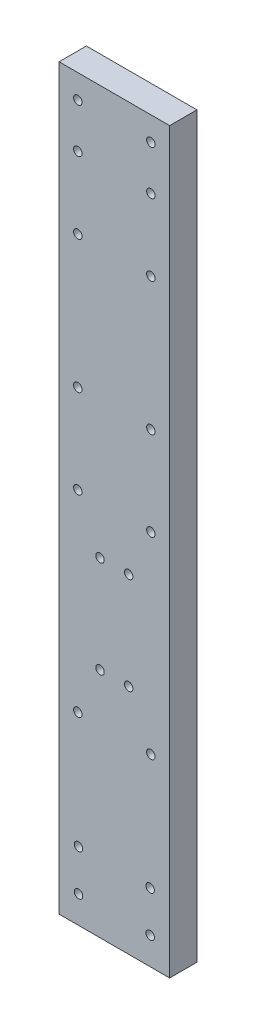
ISO-10303-21;
HEADER;
FILE_DESCRIPTION(('STEP AP214'),'2;1');
FILE_NAME('part.step','',(''),(''),'','','');
FILE_SCHEMA(('AUTOMOTIVE_DESIGN { 1 0 10303 214 1 1 1 1 }'));
ENDSEC;
DATA;
#1=APPLICATION_CONTEXT('core data for automotive mechanical design processes');
#2=APPLICATION_PROTOCOL_DEFINITION('international standard','automotive_design',2000,#1);
#3=PRODUCT_CONTEXT('',#1,'mechanical');
#4=PRODUCT('Part','Part','',(#3));
#5=PRODUCT_RELATED_PRODUCT_CATEGORY('part','',(#4));
#6=PRODUCT_DEFINITION_FORMATION('','',#4);
#7=PRODUCT_DEFINITION_CONTEXT('part definition',#1,'design');
#8=PRODUCT_DEFINITION('design','',#6,#7);
#9=PRODUCT_DEFINITION_SHAPE('','',#8);
#10=(LENGTH_UNIT() NAMED_UNIT(*) SI_UNIT(.MILLI.,.METRE.));
#11=(NAMED_UNIT(*) PLANE_ANGLE_UNIT() SI_UNIT($,.RADIAN.));
#12=(NAMED_UNIT(*) SI_UNIT($,.STERADIAN.) SOLID_ANGLE_UNIT());
#13=UNCERTAINTY_MEASURE_WITH_UNIT(LENGTH_MEASURE(1.E-05),#10,'distance_accuracy_value','');
#14=(GEOMETRIC_REPRESENTATION_CONTEXT(3) GLOBAL_UNCERTAINTY_ASSIGNED_CONTEXT((#13)) GLOBAL_UNIT_ASSIGNED_CONTEXT((#10,
#11,#12)) REPRESENTATION_CONTEXT('',''));
#15=CARTESIAN_POINT('',(0.,0.,0.));
#16=DIRECTION('',(0.,0.,1.));
#17=DIRECTION('',(1.,0.,0.));
#18=AXIS2_PLACEMENT_3D('',#15,#16,#17);
#19=CARTESIAN_POINT('',(0.,0.,4.));
#20=DIRECTION('',(0.,0.,1.));
#21=DIRECTION('',(1.,0.,0.));
#22=AXIS2_PLACEMENT_3D('',#19,#20,#21);
#23=PLANE('',#22);
#24=CARTESIAN_POINT('',(13.35,10.,4.));
#25=DIRECTION('',(0.,0.,1.));
#26=DIRECTION('',(-1.,0.,0.));
#27=AXIS2_PLACEMENT_3D('',#24,#25,#26);
#28=CIRCLE('',#27,0.62);
#29=CARTESIAN_POINT('',(12.73,10.,4.));
#30=VERTEX_POINT('',#29);
#31=EDGE_CURVE('E217',#30,#30,#28,.T.);
#32=ORIENTED_EDGE('',*,*,#31,.F.);
#33=EDGE_LOOP('',(#32));
#34=FACE_BOUND('',#33,.T.);
#35=CARTESIAN_POINT('',(2.85,10.,4.));
#36=DIRECTION('',(0.,0.,1.));
#37=DIRECTION('',(1.,0.,0.));
#38=AXIS2_PLACEMENT_3D('',#35,#36,#37);
#39=CIRCLE('',#38,0.62);
#40=CARTESIAN_POINT('',(3.47,10.,4.));
#41=VERTEX_POINT('',#40);
#42=EDGE_CURVE('E205',#41,#41,#39,.T.);
#43=ORIENTED_EDGE('',*,*,#42,.F.);
#44=EDGE_LOOP('',(#43));
#45=FACE_BOUND('',#44,.T.);
#46=CARTESIAN_POINT('',(2.74999999999998,68.21,4.));
#47=DIRECTION('',(0.,0.,1.));
#48=DIRECTION('',(1.,0.,0.));
#49=AXIS2_PLACEMENT_3D('',#46,#47,#48);
#50=CIRCLE('',#49,0.620000000000002);
#51=CARTESIAN_POINT('',(3.36999999999999,68.21,4.));
#52=VERTEX_POINT('',#51);
#53=EDGE_CURVE('E193',#52,#52,#50,.T.);
#54=ORIENTED_EDGE('',*,*,#53,.F.);
#55=EDGE_LOOP('',(#54));
#56=FACE_BOUND('',#55,.T.);
#57=CARTESIAN_POINT('',(2.74999999999999,55.21,4.));
#58=DIRECTION('',(0.,0.,1.));
#59=DIRECTION('',(1.,0.,0.));
#60=AXIS2_PLACEMENT_3D('',#57,#58,#59);
#61=CIRCLE('',#60,0.62);
#62=CARTESIAN_POINT('',(3.36999999999999,55.21,4.));
#63=VERTEX_POINT('',#62);
#64=EDGE_CURVE('E181',#63,#63,#61,.T.);
#65=ORIENTED_EDGE('',*,*,#64,.F.);
#66=EDGE_LOOP('',(#65));
#67=FACE_BOUND('',#66,.T.);
#68=CARTESIAN_POINT('',(13.45,104.66,4.));
#69=DIRECTION('',(0.,0.,1.));
#70=DIRECTION('',(-1.,0.,0.));
#71=AXIS2_PLACEMENT_3D('',#68,#69,#70);
#72=CIRCLE('',#71,0.620000000000002);
#73=CARTESIAN_POINT('',(12.83,104.66,4.));
#74=VERTEX_POINT('',#73);
#75=EDGE_CURVE('E169',#74,#74,#72,.T.);
#76=ORIENTED_EDGE('',*,*,#75,.F.);
#77=EDGE_LOOP('',(#76));
#78=FACE_BOUND('',#77,.T.);
#79=CARTESIAN_POINT('',(2.74999999999998,87.66,4.));
#80=DIRECTION('',(0.,0.,1.));
#81=DIRECTION('',(-1.,0.,0.));
#82=AXIS2_PLACEMENT_3D('',#79,#80,#81);
#83=CIRCLE('',#82,0.620000000000002);
#84=CARTESIAN_POINT('',(2.12999999999998,87.66,4.));
#85=VERTEX_POINT('',#84);
#86=EDGE_CURVE('E157',#85,#85,#83,.T.);
#87=ORIENTED_EDGE('',*,*,#86,.F.);
#88=EDGE_LOOP('',(#87));
#89=FACE_BOUND('',#88,.T.);
#90=CARTESIAN_POINT('',(2.75,27.,4.));
#91=DIRECTION('',(0.,0.,1.));
#92=DIRECTION('',(1.,0.,0.));
#93=AXIS2_PLACEMENT_3D('',#90,#91,#92);
#94=CIRCLE('',#93,0.62);
#95=CARTESIAN_POINT('',(3.37,27.,4.));
#96=VERTEX_POINT('',#95);
#97=EDGE_CURVE('E145',#96,#96,#94,.T.);
#98=ORIENTED_EDGE('',*,*,#97,.F.);
#99=EDGE_LOOP('',(#98));
#100=FACE_BOUND('',#99,.T.);
#101=CARTESIAN_POINT('',(6.,34.,4.));
#102=DIRECTION('',(0.,0.,1.));
#103=DIRECTION('',(1.,0.,0.));
#104=AXIS2_PLACEMENT_3D('',#101,#102,#103);
#105=CIRCLE('',#104,0.619999999999999);
#106=CARTESIAN_POINT('',(6.62,34.,4.));
#107=VERTEX_POINT('',#106);
#108=EDGE_CURVE('E133',#107,#107,#105,.T.);
#109=ORIENTED_EDGE('',*,*,#108,.F.);
#110=EDGE_LOOP('',(#109));
#111=FACE_BOUND('',#110,.T.);
#112=CARTESIAN_POINT('',(5.99999999999999,48.21,4.));
#113=DIRECTION('',(0.,0.,1.));
#114=DIRECTION('',(1.,0.,0.));
#115=AXIS2_PLACEMENT_3D('',#112,#113,#114);
#116=CIRCLE('',#115,0.619999999999999);
#117=CARTESIAN_POINT('',(6.61999999999999,48.21,4.));
#118=VERTEX_POINT('',#117);
#119=EDGE_CURVE('E121',#118,#118,#116,.T.);
#120=ORIENTED_EDGE('',*,*,#119,.F.);
#121=EDGE_LOOP('',(#120));
#122=FACE_BOUND('',#121,.T.);
#123=CARTESIAN_POINT('',(2.74999999999999,104.66,4.));
#124=DIRECTION('',(0.,0.,1.));
#125=DIRECTION('',(1.,0.,0.));
#126=AXIS2_PLACEMENT_3D('',#123,#124,#125);
#127=CIRCLE('',#126,0.620000000000002);
#128=CARTESIAN_POINT('',(3.36999999999999,104.66,4.));
#129=VERTEX_POINT('',#128);
#130=EDGE_CURVE('E100',#129,#129,#127,.T.);
#131=ORIENTED_EDGE('',*,*,#130,.F.);
#132=EDGE_LOOP('',(#131));
#133=FACE_BOUND('',#132,.T.);
#134=DIRECTION('',(0.,-1.,0.));
#135=VECTOR('',#134,1.);
#136=CARTESIAN_POINT('',(0.,108.14,4.));
#137=LINE('',#136,#135);
#138=CARTESIAN_POINT('',(0.,108.14,4.));
#139=VERTEX_POINT('',#138);
#140=CARTESIAN_POINT('',(0.,0.,4.));
#141=VERTEX_POINT('',#140);
#142=EDGE_CURVE('E85',#139,#141,#137,.T.);
#143=ORIENTED_EDGE('',*,*,#142,.T.);
#144=DIRECTION('',(1.,0.,0.));
#145=VECTOR('',#144,1.);
#146=CARTESIAN_POINT('',(0.,0.,4.));
#147=LINE('',#146,#145);
#148=CARTESIAN_POINT('',(16.2,0.,4.));
#149=VERTEX_POINT('',#148);
#150=EDGE_CURVE('E80',#141,#149,#147,.T.);
#151=ORIENTED_EDGE('',*,*,#150,.T.);
#152=DIRECTION('',(0.,1.,0.));
#153=VECTOR('',#152,1.);
#154=CARTESIAN_POINT('',(16.2,0.,4.));
#155=LINE('',#154,#153);
#156=CARTESIAN_POINT('',(16.2,108.14,4.));
#157=VERTEX_POINT('',#156);
#158=EDGE_CURVE('E83',#149,#157,#155,.T.);
#159=ORIENTED_EDGE('',*,*,#158,.T.);
#160=DIRECTION('',(-1.,0.,0.));
#161=VECTOR('',#160,1.);
#162=CARTESIAN_POINT('',(16.2,108.14,4.));
#163=LINE('',#162,#161);
#164=EDGE_CURVE('E50',#157,#139,#163,.T.);
#165=ORIENTED_EDGE('',*,*,#164,.T.);
#166=EDGE_LOOP('',(#143,#151,#159,#165));
#167=FACE_BOUND('',#166,.T.);
#168=CARTESIAN_POINT('',(10.2,48.21,4.));
#169=DIRECTION('',(0.,0.,1.));
#170=DIRECTION('',(1.,0.,0.));
#171=AXIS2_PLACEMENT_3D('',#168,#169,#170);
#172=CIRCLE('',#171,0.62);
#173=CARTESIAN_POINT('',(10.82,48.21,4.));
#174=VERTEX_POINT('',#173);
#175=EDGE_CURVE('E115',#174,#174,#172,.T.);
#176=ORIENTED_EDGE('',*,*,#175,.F.);
#177=EDGE_LOOP('',(#176));
#178=FACE_BOUND('',#177,.T.);
#179=CARTESIAN_POINT('',(10.2,34.,4.));
#180=DIRECTION('',(0.,0.,1.));
#181=DIRECTION('',(1.,0.,0.));
#182=AXIS2_PLACEMENT_3D('',#179,#180,#181);
#183=CIRCLE('',#182,0.62);
#184=CARTESIAN_POINT('',(10.82,34.,4.));
#185=VERTEX_POINT('',#184);
#186=EDGE_CURVE('E127',#185,#185,#183,.T.);
#187=ORIENTED_EDGE('',*,*,#186,.F.);
#188=EDGE_LOOP('',(#187));
#189=FACE_BOUND('',#188,.T.);
#190=CARTESIAN_POINT('',(13.45,27.,4.));
#191=DIRECTION('',(0.,0.,1.));
#192=DIRECTION('',(1.,0.,0.));
#193=AXIS2_PLACEMENT_3D('',#190,#191,#192);
#194=CIRCLE('',#193,0.62);
#195=CARTESIAN_POINT('',(14.07,27.,4.));
#196=VERTEX_POINT('',#195);
#197=EDGE_CURVE('E139',#196,#196,#194,.T.);
#198=ORIENTED_EDGE('',*,*,#197,.F.);
#199=EDGE_LOOP('',(#198));
#200=FACE_BOUND('',#199,.T.);
#201=CARTESIAN_POINT('',(13.45,55.21,4.));
#202=DIRECTION('',(0.,0.,1.));
#203=DIRECTION('',(1.,0.,0.));
#204=AXIS2_PLACEMENT_3D('',#201,#202,#203);
#205=CIRCLE('',#204,0.62);
#206=CARTESIAN_POINT('',(14.07,55.21,4.));
#207=VERTEX_POINT('',#206);
#208=EDGE_CURVE('E151',#207,#207,#205,.T.);
#209=ORIENTED_EDGE('',*,*,#208,.F.);
#210=EDGE_LOOP('',(#209));
#211=FACE_BOUND('',#210,.T.);
#212=CARTESIAN_POINT('',(13.45,87.66,4.));
#213=DIRECTION('',(0.,0.,1.));
#214=DIRECTION('',(-1.,0.,0.));
#215=AXIS2_PLACEMENT_3D('',#212,#213,#214);
#216=CIRCLE('',#215,0.620000000000002);
#217=CARTESIAN_POINT('',(12.83,87.66,4.));
#218=VERTEX_POINT('',#217);
#219=EDGE_CURVE('E163',#218,#218,#216,.T.);
#220=ORIENTED_EDGE('',*,*,#219,.F.);
#221=EDGE_LOOP('',(#220));
#222=FACE_BOUND('',#221,.T.);
#223=CARTESIAN_POINT('',(13.45,98.16,4.));
#224=DIRECTION('',(0.,0.,1.));
#225=DIRECTION('',(-1.,0.,0.));
#226=AXIS2_PLACEMENT_3D('',#223,#224,#225);
#227=CIRCLE('',#226,0.620000000000002);
#228=CARTESIAN_POINT('',(12.83,98.16,4.));
#229=VERTEX_POINT('',#228);
#230=EDGE_CURVE('E175',#229,#229,#227,.T.);
#231=ORIENTED_EDGE('',*,*,#230,.F.);
#232=EDGE_LOOP('',(#231));
#233=FACE_BOUND('',#232,.T.);
#234=CARTESIAN_POINT('',(13.45,68.21,4.));
#235=DIRECTION('',(0.,0.,1.));
#236=DIRECTION('',(1.,0.,0.));
#237=AXIS2_PLACEMENT_3D('',#234,#235,#236);
#238=CIRCLE('',#237,0.620000000000002);
#239=CARTESIAN_POINT('',(14.07,68.21,4.));
#240=VERTEX_POINT('',#239);
#241=EDGE_CURVE('E187',#240,#240,#238,.T.);
#242=ORIENTED_EDGE('',*,*,#241,.F.);
#243=EDGE_LOOP('',(#242));
#244=FACE_BOUND('',#243,.T.);
#245=CARTESIAN_POINT('',(2.74999999999999,98.16,4.));
#246=DIRECTION('',(0.,0.,1.));
#247=DIRECTION('',(1.,0.,0.));
#248=AXIS2_PLACEMENT_3D('',#245,#246,#247);
#249=CIRCLE('',#248,0.620000000000002);
#250=CARTESIAN_POINT('',(3.36999999999999,98.16,4.));
#251=VERTEX_POINT('',#250);
#252=EDGE_CURVE('E199',#251,#251,#249,.T.);
#253=ORIENTED_EDGE('',*,*,#252,.F.);
#254=EDGE_LOOP('',(#253));
#255=FACE_BOUND('',#254,.T.);
#256=CARTESIAN_POINT('',(2.85,4.,4.));
#257=DIRECTION('',(0.,0.,1.));
#258=DIRECTION('',(1.,0.,0.));
#259=AXIS2_PLACEMENT_3D('',#256,#257,#258);
#260=CIRCLE('',#259,0.62);
#261=CARTESIAN_POINT('',(3.47,4.,4.));
#262=VERTEX_POINT('',#261);
#263=EDGE_CURVE('E211',#262,#262,#260,.T.);
#264=ORIENTED_EDGE('',*,*,#263,.F.);
#265=EDGE_LOOP('',(#264));
#266=FACE_BOUND('',#265,.T.);
#267=CARTESIAN_POINT('',(13.35,4.,4.));
#268=DIRECTION('',(0.,0.,1.));
#269=DIRECTION('',(-1.,0.,0.));
#270=AXIS2_PLACEMENT_3D('',#267,#268,#269);
#271=CIRCLE('',#270,0.620000000000001);
#272=CARTESIAN_POINT('',(12.73,4.,4.));
#273=VERTEX_POINT('',#272);
#274=EDGE_CURVE('E223',#273,#273,#271,.T.);
#275=ORIENTED_EDGE('',*,*,#274,.F.);
#276=EDGE_LOOP('',(#275));
#277=FACE_BOUND('',#276,.T.);
#278=ADVANCED_FACE('F33',(#34,#45,#56,#67,#78,#89,#100,#111,#122,#133,#167,#178,#189,#200,#211,
#222,#233,#244,#255,#266,#277),#23,.T.);
#279=CARTESIAN_POINT('',(0.,0.,0.));
#280=DIRECTION('',(0.,0.,1.));
#281=DIRECTION('',(1.,0.,0.));
#282=AXIS2_PLACEMENT_3D('',#279,#280,#281);
#283=PLANE('',#282);
#284=CARTESIAN_POINT('',(13.35,10.,0.));
#285=DIRECTION('',(0.,0.,1.));
#286=DIRECTION('',(-1.,0.,0.));
#287=AXIS2_PLACEMENT_3D('',#284,#285,#286);
#288=CIRCLE('',#287,0.62);
#289=CARTESIAN_POINT('',(12.73,10.,0.));
#290=VERTEX_POINT('',#289);
#291=EDGE_CURVE('E220',#290,#290,#288,.T.);
#292=ORIENTED_EDGE('',*,*,#291,.T.);
#293=EDGE_LOOP('',(#292));
#294=FACE_BOUND('',#293,.T.);
#295=CARTESIAN_POINT('',(2.85,10.,0.));
#296=DIRECTION('',(0.,0.,1.));
#297=DIRECTION('',(1.,0.,0.));
#298=AXIS2_PLACEMENT_3D('',#295,#296,#297);
#299=CIRCLE('',#298,0.62);
#300=CARTESIAN_POINT('',(3.47,10.,0.));
#301=VERTEX_POINT('',#300);
#302=EDGE_CURVE('E208',#301,#301,#299,.T.);
#303=ORIENTED_EDGE('',*,*,#302,.T.);
#304=EDGE_LOOP('',(#303));
#305=FACE_BOUND('',#304,.T.);
#306=CARTESIAN_POINT('',(2.74999999999998,68.21,0.));
#307=DIRECTION('',(0.,0.,1.));
#308=DIRECTION('',(1.,0.,0.));
#309=AXIS2_PLACEMENT_3D('',#306,#307,#308);
#310=CIRCLE('',#309,0.620000000000002);
#311=CARTESIAN_POINT('',(3.36999999999999,68.21,0.));
#312=VERTEX_POINT('',#311);
#313=EDGE_CURVE('E196',#312,#312,#310,.T.);
#314=ORIENTED_EDGE('',*,*,#313,.T.);
#315=EDGE_LOOP('',(#314));
#316=FACE_BOUND('',#315,.T.);
#317=CARTESIAN_POINT('',(2.74999999999999,55.21,0.));
#318=DIRECTION('',(0.,0.,1.));
#319=DIRECTION('',(1.,0.,0.));
#320=AXIS2_PLACEMENT_3D('',#317,#318,#319);
#321=CIRCLE('',#320,0.62);
#322=CARTESIAN_POINT('',(3.36999999999999,55.21,0.));
#323=VERTEX_POINT('',#322);
#324=EDGE_CURVE('E184',#323,#323,#321,.T.);
#325=ORIENTED_EDGE('',*,*,#324,.T.);
#326=EDGE_LOOP('',(#325));
#327=FACE_BOUND('',#326,.T.);
#328=CARTESIAN_POINT('',(13.45,104.66,0.));
#329=DIRECTION('',(0.,0.,1.));
#330=DIRECTION('',(-1.,0.,0.));
#331=AXIS2_PLACEMENT_3D('',#328,#329,#330);
#332=CIRCLE('',#331,0.620000000000002);
#333=CARTESIAN_POINT('',(12.83,104.66,0.));
#334=VERTEX_POINT('',#333);
#335=EDGE_CURVE('E172',#334,#334,#332,.T.);
#336=ORIENTED_EDGE('',*,*,#335,.T.);
#337=EDGE_LOOP('',(#336));
#338=FACE_BOUND('',#337,.T.);
#339=CARTESIAN_POINT('',(2.74999999999998,87.66,0.));
#340=DIRECTION('',(0.,0.,1.));
#341=DIRECTION('',(-1.,0.,0.));
#342=AXIS2_PLACEMENT_3D('',#339,#340,#341);
#343=CIRCLE('',#342,0.620000000000002);
#344=CARTESIAN_POINT('',(2.12999999999998,87.66,0.));
#345=VERTEX_POINT('',#344);
#346=EDGE_CURVE('E160',#345,#345,#343,.T.);
#347=ORIENTED_EDGE('',*,*,#346,.T.);
#348=EDGE_LOOP('',(#347));
#349=FACE_BOUND('',#348,.T.);
#350=CARTESIAN_POINT('',(2.75,27.,0.));
#351=DIRECTION('',(0.,0.,1.));
#352=DIRECTION('',(1.,0.,0.));
#353=AXIS2_PLACEMENT_3D('',#350,#351,#352);
#354=CIRCLE('',#353,0.62);
#355=CARTESIAN_POINT('',(3.37,27.,0.));
#356=VERTEX_POINT('',#355);
#357=EDGE_CURVE('E148',#356,#356,#354,.T.);
#358=ORIENTED_EDGE('',*,*,#357,.T.);
#359=EDGE_LOOP('',(#358));
#360=FACE_BOUND('',#359,.T.);
#361=CARTESIAN_POINT('',(6.,34.,0.));
#362=DIRECTION('',(0.,0.,1.));
#363=DIRECTION('',(1.,0.,0.));
#364=AXIS2_PLACEMENT_3D('',#361,#362,#363);
#365=CIRCLE('',#364,0.619999999999999);
#366=CARTESIAN_POINT('',(6.62,34.,0.));
#367=VERTEX_POINT('',#366);
#368=EDGE_CURVE('E136',#367,#367,#365,.T.);
#369=ORIENTED_EDGE('',*,*,#368,.T.);
#370=EDGE_LOOP('',(#369));
#371=FACE_BOUND('',#370,.T.);
#372=CARTESIAN_POINT('',(5.99999999999999,48.21,0.));
#373=DIRECTION('',(0.,0.,1.));
#374=DIRECTION('',(1.,0.,0.));
#375=AXIS2_PLACEMENT_3D('',#372,#373,#374);
#376=CIRCLE('',#375,0.619999999999999);
#377=CARTESIAN_POINT('',(6.61999999999999,48.21,0.));
#378=VERTEX_POINT('',#377);
#379=EDGE_CURVE('E124',#378,#378,#376,.T.);
#380=ORIENTED_EDGE('',*,*,#379,.T.);
#381=EDGE_LOOP('',(#380));
#382=FACE_BOUND('',#381,.T.);
#383=CARTESIAN_POINT('',(2.74999999999999,104.66,0.));
#384=DIRECTION('',(0.,0.,1.));
#385=DIRECTION('',(1.,0.,0.));
#386=AXIS2_PLACEMENT_3D('',#383,#384,#385);
#387=CIRCLE('',#386,0.620000000000002);
#388=CARTESIAN_POINT('',(3.36999999999999,104.66,0.));
#389=VERTEX_POINT('',#388);
#390=EDGE_CURVE('E112',#389,#389,#387,.T.);
#391=ORIENTED_EDGE('',*,*,#390,.T.);
#392=EDGE_LOOP('',(#391));
#393=FACE_BOUND('',#392,.T.);
#394=DIRECTION('',(0.,-1.,0.));
#395=VECTOR('',#394,1.);
#396=CARTESIAN_POINT('',(0.,108.14,0.));
#397=LINE('',#396,#395);
#398=CARTESIAN_POINT('',(0.,108.14,0.));
#399=VERTEX_POINT('',#398);
#400=CARTESIAN_POINT('',(0.,0.,0.));
#401=VERTEX_POINT('',#400);
#402=EDGE_CURVE('E97',#399,#401,#397,.T.);
#403=ORIENTED_EDGE('',*,*,#402,.F.);
#404=DIRECTION('',(-1.,0.,0.));
#405=VECTOR('',#404,1.);
#406=CARTESIAN_POINT('',(16.2,108.14,0.));
#407=LINE('',#406,#405);
#408=CARTESIAN_POINT('',(16.2,108.14,0.));
#409=VERTEX_POINT('',#408);
#410=EDGE_CURVE('E73',#409,#399,#407,.T.);
#411=ORIENTED_EDGE('',*,*,#410,.F.);
#412=DIRECTION('',(0.,1.,0.));
#413=VECTOR('',#412,1.);
#414=CARTESIAN_POINT('',(16.2,0.,0.));
#415=LINE('',#414,#413);
#416=CARTESIAN_POINT('',(16.2,0.,0.));
#417=VERTEX_POINT('',#416);
#418=EDGE_CURVE('E67',#417,#409,#415,.T.);
#419=ORIENTED_EDGE('',*,*,#418,.F.);
#420=DIRECTION('',(1.,0.,0.));
#421=VECTOR('',#420,1.);
#422=CARTESIAN_POINT('',(0.,0.,0.));
#423=LINE('',#422,#421);
#424=EDGE_CURVE('E89',#401,#417,#423,.T.);
#425=ORIENTED_EDGE('',*,*,#424,.F.);
#426=EDGE_LOOP('',(#403,#411,#419,#425));
#427=FACE_BOUND('',#426,.T.);
#428=CARTESIAN_POINT('',(10.2,48.21,0.));
#429=DIRECTION('',(0.,0.,1.));
#430=DIRECTION('',(1.,0.,0.));
#431=AXIS2_PLACEMENT_3D('',#428,#429,#430);
#432=CIRCLE('',#431,0.62);
#433=CARTESIAN_POINT('',(10.82,48.21,0.));
#434=VERTEX_POINT('',#433);
#435=EDGE_CURVE('E118',#434,#434,#432,.T.);
#436=ORIENTED_EDGE('',*,*,#435,.T.);
#437=EDGE_LOOP('',(#436));
#438=FACE_BOUND('',#437,.T.);
#439=CARTESIAN_POINT('',(10.2,34.,0.));
#440=DIRECTION('',(0.,0.,1.));
#441=DIRECTION('',(1.,0.,0.));
#442=AXIS2_PLACEMENT_3D('',#439,#440,#441);
#443=CIRCLE('',#442,0.62);
#444=CARTESIAN_POINT('',(10.82,34.,0.));
#445=VERTEX_POINT('',#444);
#446=EDGE_CURVE('E130',#445,#445,#443,.T.);
#447=ORIENTED_EDGE('',*,*,#446,.T.);
#448=EDGE_LOOP('',(#447));
#449=FACE_BOUND('',#448,.T.);
#450=CARTESIAN_POINT('',(13.45,27.,0.));
#451=DIRECTION('',(0.,0.,1.));
#452=DIRECTION('',(1.,0.,0.));
#453=AXIS2_PLACEMENT_3D('',#450,#451,#452);
#454=CIRCLE('',#453,0.62);
#455=CARTESIAN_POINT('',(14.07,27.,0.));
#456=VERTEX_POINT('',#455);
#457=EDGE_CURVE('E142',#456,#456,#454,.T.);
#458=ORIENTED_EDGE('',*,*,#457,.T.);
#459=EDGE_LOOP('',(#458));
#460=FACE_BOUND('',#459,.T.);
#461=CARTESIAN_POINT('',(13.45,55.21,0.));
#462=DIRECTION('',(0.,0.,1.));
#463=DIRECTION('',(1.,0.,0.));
#464=AXIS2_PLACEMENT_3D('',#461,#462,#463);
#465=CIRCLE('',#464,0.62);
#466=CARTESIAN_POINT('',(14.07,55.21,0.));
#467=VERTEX_POINT('',#466);
#468=EDGE_CURVE('E154',#467,#467,#465,.T.);
#469=ORIENTED_EDGE('',*,*,#468,.T.);
#470=EDGE_LOOP('',(#469));
#471=FACE_BOUND('',#470,.T.);
#472=CARTESIAN_POINT('',(13.45,87.66,0.));
#473=DIRECTION('',(0.,0.,1.));
#474=DIRECTION('',(-1.,0.,0.));
#475=AXIS2_PLACEMENT_3D('',#472,#473,#474);
#476=CIRCLE('',#475,0.620000000000002);
#477=CARTESIAN_POINT('',(12.83,87.66,0.));
#478=VERTEX_POINT('',#477);
#479=EDGE_CURVE('E166',#478,#478,#476,.T.);
#480=ORIENTED_EDGE('',*,*,#479,.T.);
#481=EDGE_LOOP('',(#480));
#482=FACE_BOUND('',#481,.T.);
#483=CARTESIAN_POINT('',(13.45,98.16,0.));
#484=DIRECTION('',(0.,0.,1.));
#485=DIRECTION('',(-1.,0.,0.));
#486=AXIS2_PLACEMENT_3D('',#483,#484,#485);
#487=CIRCLE('',#486,0.620000000000002);
#488=CARTESIAN_POINT('',(12.83,98.16,0.));
#489=VERTEX_POINT('',#488);
#490=EDGE_CURVE('E178',#489,#489,#487,.T.);
#491=ORIENTED_EDGE('',*,*,#490,.T.);
#492=EDGE_LOOP('',(#491));
#493=FACE_BOUND('',#492,.T.);
#494=CARTESIAN_POINT('',(13.45,68.21,0.));
#495=DIRECTION('',(0.,0.,1.));
#496=DIRECTION('',(1.,0.,0.));
#497=AXIS2_PLACEMENT_3D('',#494,#495,#496);
#498=CIRCLE('',#497,0.620000000000002);
#499=CARTESIAN_POINT('',(14.07,68.21,0.));
#500=VERTEX_POINT('',#499);
#501=EDGE_CURVE('E190',#500,#500,#498,.T.);
#502=ORIENTED_EDGE('',*,*,#501,.T.);
#503=EDGE_LOOP('',(#502));
#504=FACE_BOUND('',#503,.T.);
#505=CARTESIAN_POINT('',(2.74999999999999,98.16,0.));
#506=DIRECTION('',(0.,0.,1.));
#507=DIRECTION('',(1.,0.,0.));
#508=AXIS2_PLACEMENT_3D('',#505,#506,#507);
#509=CIRCLE('',#508,0.620000000000002);
#510=CARTESIAN_POINT('',(3.36999999999999,98.16,0.));
#511=VERTEX_POINT('',#510);
#512=EDGE_CURVE('E202',#511,#511,#509,.T.);
#513=ORIENTED_EDGE('',*,*,#512,.T.);
#514=EDGE_LOOP('',(#513));
#515=FACE_BOUND('',#514,.T.);
#516=CARTESIAN_POINT('',(2.85,4.,0.));
#517=DIRECTION('',(0.,0.,1.));
#518=DIRECTION('',(1.,0.,0.));
#519=AXIS2_PLACEMENT_3D('',#516,#517,#518);
#520=CIRCLE('',#519,0.62);
#521=CARTESIAN_POINT('',(3.47,4.,0.));
#522=VERTEX_POINT('',#521);
#523=EDGE_CURVE('E214',#522,#522,#520,.T.);
#524=ORIENTED_EDGE('',*,*,#523,.T.);
#525=EDGE_LOOP('',(#524));
#526=FACE_BOUND('',#525,.T.);
#527=CARTESIAN_POINT('',(13.35,4.,0.));
#528=DIRECTION('',(0.,0.,1.));
#529=DIRECTION('',(-1.,0.,0.));
#530=AXIS2_PLACEMENT_3D('',#527,#528,#529);
#531=CIRCLE('',#530,0.620000000000001);
#532=CARTESIAN_POINT('',(12.73,4.,0.));
#533=VERTEX_POINT('',#532);
#534=EDGE_CURVE('E226',#533,#533,#531,.T.);
#535=ORIENTED_EDGE('',*,*,#534,.T.);
#536=EDGE_LOOP('',(#535));
#537=FACE_BOUND('',#536,.T.);
#538=ADVANCED_FACE('F108',(#294,#305,#316,#327,#338,#349,#360,#371,#382,#393,#427,#438,#449,
#460,#471,#482,#493,#504,#515,#526,#537),#283,.F.);
#539=CARTESIAN_POINT('',(0.,108.14,4.));
#540=DIRECTION('',(1.,0.,0.));
#541=DIRECTION('',(0.,1.,0.));
#542=AXIS2_PLACEMENT_3D('',#539,#540,#541);
#543=PLANE('',#542);
#544=ORIENTED_EDGE('',*,*,#402,.T.);
#545=DIRECTION('',(0.,0.,-1.));
#546=VECTOR('',#545,1.);
#547=CARTESIAN_POINT('',(0.,0.,4.));
#548=LINE('',#547,#546);
#549=EDGE_CURVE('E11',#141,#401,#548,.T.);
#550=ORIENTED_EDGE('',*,*,#549,.F.);
#551=ORIENTED_EDGE('',*,*,#142,.F.);
#552=DIRECTION('',(0.,0.,-1.));
#553=VECTOR('',#552,1.);
#554=CARTESIAN_POINT('',(0.,108.14,4.));
#555=LINE('',#554,#553);
#556=EDGE_CURVE('E93',#139,#399,#555,.T.);
#557=ORIENTED_EDGE('',*,*,#556,.T.);
#558=EDGE_LOOP('',(#544,#550,#551,#557));
#559=FACE_BOUND('',#558,.T.);
#560=ADVANCED_FACE('F35',(#559),#543,.F.);
#561=CARTESIAN_POINT('',(0.,0.,4.));
#562=DIRECTION('',(0.,1.,0.));
#563=DIRECTION('',(-1.,0.,0.));
#564=AXIS2_PLACEMENT_3D('',#561,#562,#563);
#565=PLANE('',#564);
#566=ORIENTED_EDGE('',*,*,#424,.T.);
#567=DIRECTION('',(0.,0.,-1.));
#568=VECTOR('',#567,1.);
#569=CARTESIAN_POINT('',(16.2,0.,4.));
#570=LINE('',#569,#568);
#571=EDGE_CURVE('E42',#149,#417,#570,.T.);
#572=ORIENTED_EDGE('',*,*,#571,.F.);
#573=ORIENTED_EDGE('',*,*,#150,.F.);
#574=ORIENTED_EDGE('',*,*,#549,.T.);
#575=EDGE_LOOP('',(#566,#572,#573,#574));
#576=FACE_BOUND('',#575,.T.);
#577=ADVANCED_FACE('F88',(#576),#565,.F.);
#578=CARTESIAN_POINT('',(16.2,0.,4.));
#579=DIRECTION('',(-1.,0.,0.));
#580=DIRECTION('',(0.,-1.,0.));
#581=AXIS2_PLACEMENT_3D('',#578,#579,#580);
#582=PLANE('',#581);
#583=ORIENTED_EDGE('',*,*,#418,.T.);
#584=DIRECTION('',(0.,0.,-1.));
#585=VECTOR('',#584,1.);
#586=CARTESIAN_POINT('',(16.2,108.14,4.));
#587=LINE('',#586,#585);
#588=EDGE_CURVE('E90',#157,#409,#587,.T.);
#589=ORIENTED_EDGE('',*,*,#588,.F.);
#590=ORIENTED_EDGE('',*,*,#158,.F.);
#591=ORIENTED_EDGE('',*,*,#571,.T.);
#592=EDGE_LOOP('',(#583,#589,#590,#591));
#593=FACE_BOUND('',#592,.T.);
#594=ADVANCED_FACE('F91',(#593),#582,.F.);
#595=CARTESIAN_POINT('',(16.2,108.14,4.));
#596=DIRECTION('',(0.,-1.,0.));
#597=DIRECTION('',(0.,0.,-1.));
#598=AXIS2_PLACEMENT_3D('',#595,#596,#597);
#599=PLANE('',#598);
#600=ORIENTED_EDGE('',*,*,#410,.T.);
#601=ORIENTED_EDGE('',*,*,#556,.F.);
#602=ORIENTED_EDGE('',*,*,#164,.F.);
#603=ORIENTED_EDGE('',*,*,#588,.T.);
#604=EDGE_LOOP('',(#600,#601,#602,#603));
#605=FACE_BOUND('',#604,.T.);
#606=ADVANCED_FACE('F105',(#605),#599,.F.);
#607=CARTESIAN_POINT('',(2.74999999999999,104.66,4.));
#608=DIRECTION('',(0.,0.,-1.));
#609=DIRECTION('',(-1.,0.,0.));
#610=AXIS2_PLACEMENT_3D('',#607,#608,#609);
#611=CYLINDRICAL_SURFACE('',#610,0.620000000000002);
#612=ORIENTED_EDGE('',*,*,#130,.T.);
#613=EDGE_LOOP('',(#612));
#614=FACE_BOUND('',#613,.T.);
#615=ORIENTED_EDGE('',*,*,#390,.F.);
#616=EDGE_LOOP('',(#615));
#617=FACE_BOUND('',#616,.T.);
#618=ADVANCED_FACE('F246',(#614,#617),#611,.F.);
#619=CARTESIAN_POINT('',(10.2,48.21,4.));
#620=DIRECTION('',(0.,0.,-1.));
#621=DIRECTION('',(-1.,0.,0.));
#622=AXIS2_PLACEMENT_3D('',#619,#620,#621);
#623=CYLINDRICAL_SURFACE('',#622,0.62);
#624=ORIENTED_EDGE('',*,*,#175,.T.);
#625=EDGE_LOOP('',(#624));
#626=FACE_BOUND('',#625,.T.);
#627=ORIENTED_EDGE('',*,*,#435,.F.);
#628=EDGE_LOOP('',(#627));
#629=FACE_BOUND('',#628,.T.);
#630=ADVANCED_FACE('F292',(#626,#629),#623,.F.);
#631=CARTESIAN_POINT('',(5.99999999999999,48.21,4.));
#632=DIRECTION('',(0.,0.,-1.));
#633=DIRECTION('',(-1.,0.,0.));
#634=AXIS2_PLACEMENT_3D('',#631,#632,#633);
#635=CYLINDRICAL_SURFACE('',#634,0.619999999999999);
#636=ORIENTED_EDGE('',*,*,#119,.T.);
#637=EDGE_LOOP('',(#636));
#638=FACE_BOUND('',#637,.T.);
#639=ORIENTED_EDGE('',*,*,#379,.F.);
#640=EDGE_LOOP('',(#639));
#641=FACE_BOUND('',#640,.T.);
#642=ADVANCED_FACE('F300',(#638,#641),#635,.F.);
#643=CARTESIAN_POINT('',(10.2,34.,4.));
#644=DIRECTION('',(0.,0.,-1.));
#645=DIRECTION('',(-1.,0.,0.));
#646=AXIS2_PLACEMENT_3D('',#643,#644,#645);
#647=CYLINDRICAL_SURFACE('',#646,0.62);
#648=ORIENTED_EDGE('',*,*,#186,.T.);
#649=EDGE_LOOP('',(#648));
#650=FACE_BOUND('',#649,.T.);
#651=ORIENTED_EDGE('',*,*,#446,.F.);
#652=EDGE_LOOP('',(#651));
#653=FACE_BOUND('',#652,.T.);
#654=ADVANCED_FACE('F308',(#650,#653),#647,.F.);
#655=CARTESIAN_POINT('',(6.,34.,4.));
#656=DIRECTION('',(0.,0.,-1.));
#657=DIRECTION('',(-1.,0.,0.));
#658=AXIS2_PLACEMENT_3D('',#655,#656,#657);
#659=CYLINDRICAL_SURFACE('',#658,0.619999999999999);
#660=ORIENTED_EDGE('',*,*,#108,.T.);
#661=EDGE_LOOP('',(#660));
#662=FACE_BOUND('',#661,.T.);
#663=ORIENTED_EDGE('',*,*,#368,.F.);
#664=EDGE_LOOP('',(#663));
#665=FACE_BOUND('',#664,.T.);
#666=ADVANCED_FACE('F317',(#662,#665),#659,.F.);
#667=CARTESIAN_POINT('',(13.45,27.,4.));
#668=DIRECTION('',(0.,0.,-1.));
#669=DIRECTION('',(-1.,0.,0.));
#670=AXIS2_PLACEMENT_3D('',#667,#668,#669);
#671=CYLINDRICAL_SURFACE('',#670,0.62);
#672=ORIENTED_EDGE('',*,*,#197,.T.);
#673=EDGE_LOOP('',(#672));
#674=FACE_BOUND('',#673,.T.);
#675=ORIENTED_EDGE('',*,*,#457,.F.);
#676=EDGE_LOOP('',(#675));
#677=FACE_BOUND('',#676,.T.);
#678=ADVANCED_FACE('F326',(#674,#677),#671,.F.);
#679=CARTESIAN_POINT('',(2.75,27.,4.));
#680=DIRECTION('',(0.,0.,-1.));
#681=DIRECTION('',(-1.,0.,0.));
#682=AXIS2_PLACEMENT_3D('',#679,#680,#681);
#683=CYLINDRICAL_SURFACE('',#682,0.62);
#684=ORIENTED_EDGE('',*,*,#97,.T.);
#685=EDGE_LOOP('',(#684));
#686=FACE_BOUND('',#685,.T.);
#687=ORIENTED_EDGE('',*,*,#357,.F.);
#688=EDGE_LOOP('',(#687));
#689=FACE_BOUND('',#688,.T.);
#690=ADVANCED_FACE('F335',(#686,#689),#683,.F.);
#691=CARTESIAN_POINT('',(13.45,55.21,4.));
#692=DIRECTION('',(0.,0.,-1.));
#693=DIRECTION('',(-1.,0.,0.));
#694=AXIS2_PLACEMENT_3D('',#691,#692,#693);
#695=CYLINDRICAL_SURFACE('',#694,0.62);
#696=ORIENTED_EDGE('',*,*,#208,.T.);
#697=EDGE_LOOP('',(#696));
#698=FACE_BOUND('',#697,.T.);
#699=ORIENTED_EDGE('',*,*,#468,.F.);
#700=EDGE_LOOP('',(#699));
#701=FACE_BOUND('',#700,.T.);
#702=ADVANCED_FACE('F344',(#698,#701),#695,.F.);
#703=CARTESIAN_POINT('',(2.74999999999998,87.66,4.));
#704=DIRECTION('',(0.,0.,-1.));
#705=DIRECTION('',(-1.,0.,0.));
#706=AXIS2_PLACEMENT_3D('',#703,#704,#705);
#707=CYLINDRICAL_SURFACE('',#706,0.620000000000002);
#708=ORIENTED_EDGE('',*,*,#86,.T.);
#709=EDGE_LOOP('',(#708));
#710=FACE_BOUND('',#709,.T.);
#711=ORIENTED_EDGE('',*,*,#346,.F.);
#712=EDGE_LOOP('',(#711));
#713=FACE_BOUND('',#712,.T.);
#714=ADVANCED_FACE('F353',(#710,#713),#707,.F.);
#715=CARTESIAN_POINT('',(13.45,87.66,4.));
#716=DIRECTION('',(0.,0.,-1.));
#717=DIRECTION('',(-1.,0.,0.));
#718=AXIS2_PLACEMENT_3D('',#715,#716,#717);
#719=CYLINDRICAL_SURFACE('',#718,0.620000000000002);
#720=ORIENTED_EDGE('',*,*,#219,.T.);
#721=EDGE_LOOP('',(#720));
#722=FACE_BOUND('',#721,.T.);
#723=ORIENTED_EDGE('',*,*,#479,.F.);
#724=EDGE_LOOP('',(#723));
#725=FACE_BOUND('',#724,.T.);
#726=ADVANCED_FACE('F362',(#722,#725),#719,.F.);
#727=CARTESIAN_POINT('',(13.45,104.66,4.));
#728=DIRECTION('',(0.,0.,-1.));
#729=DIRECTION('',(-1.,0.,0.));
#730=AXIS2_PLACEMENT_3D('',#727,#728,#729);
#731=CYLINDRICAL_SURFACE('',#730,0.620000000000002);
#732=ORIENTED_EDGE('',*,*,#75,.T.);
#733=EDGE_LOOP('',(#732));
#734=FACE_BOUND('',#733,.T.);
#735=ORIENTED_EDGE('',*,*,#335,.F.);
#736=EDGE_LOOP('',(#735));
#737=FACE_BOUND('',#736,.T.);
#738=ADVANCED_FACE('F371',(#734,#737),#731,.F.);
#739=CARTESIAN_POINT('',(13.45,98.16,4.));
#740=DIRECTION('',(0.,0.,-1.));
#741=DIRECTION('',(-1.,0.,0.));
#742=AXIS2_PLACEMENT_3D('',#739,#740,#741);
#743=CYLINDRICAL_SURFACE('',#742,0.620000000000002);
#744=ORIENTED_EDGE('',*,*,#230,.T.);
#745=EDGE_LOOP('',(#744));
#746=FACE_BOUND('',#745,.T.);
#747=ORIENTED_EDGE('',*,*,#490,.F.);
#748=EDGE_LOOP('',(#747));
#749=FACE_BOUND('',#748,.T.);
#750=ADVANCED_FACE('F380',(#746,#749),#743,.F.);
#751=CARTESIAN_POINT('',(2.74999999999999,55.21,4.));
#752=DIRECTION('',(0.,0.,-1.));
#753=DIRECTION('',(-1.,0.,0.));
#754=AXIS2_PLACEMENT_3D('',#751,#752,#753);
#755=CYLINDRICAL_SURFACE('',#754,0.62);
#756=ORIENTED_EDGE('',*,*,#64,.T.);
#757=EDGE_LOOP('',(#756));
#758=FACE_BOUND('',#757,.T.);
#759=ORIENTED_EDGE('',*,*,#324,.F.);
#760=EDGE_LOOP('',(#759));
#761=FACE_BOUND('',#760,.T.);
#762=ADVANCED_FACE('F389',(#758,#761),#755,.F.);
#763=CARTESIAN_POINT('',(13.45,68.21,4.));
#764=DIRECTION('',(0.,0.,-1.));
#765=DIRECTION('',(-1.,0.,0.));
#766=AXIS2_PLACEMENT_3D('',#763,#764,#765);
#767=CYLINDRICAL_SURFACE('',#766,0.620000000000002);
#768=ORIENTED_EDGE('',*,*,#241,.T.);
#769=EDGE_LOOP('',(#768));
#770=FACE_BOUND('',#769,.T.);
#771=ORIENTED_EDGE('',*,*,#501,.F.);
#772=EDGE_LOOP('',(#771));
#773=FACE_BOUND('',#772,.T.);
#774=ADVANCED_FACE('F398',(#770,#773),#767,.F.);
#775=CARTESIAN_POINT('',(2.74999999999998,68.21,4.));
#776=DIRECTION('',(0.,0.,-1.));
#777=DIRECTION('',(-1.,0.,0.));
#778=AXIS2_PLACEMENT_3D('',#775,#776,#777);
#779=CYLINDRICAL_SURFACE('',#778,0.620000000000002);
#780=ORIENTED_EDGE('',*,*,#53,.T.);
#781=EDGE_LOOP('',(#780));
#782=FACE_BOUND('',#781,.T.);
#783=ORIENTED_EDGE('',*,*,#313,.F.);
#784=EDGE_LOOP('',(#783));
#785=FACE_BOUND('',#784,.T.);
#786=ADVANCED_FACE('F407',(#782,#785),#779,.F.);
#787=CARTESIAN_POINT('',(2.74999999999999,98.16,4.));
#788=DIRECTION('',(0.,0.,-1.));
#789=DIRECTION('',(-1.,0.,0.));
#790=AXIS2_PLACEMENT_3D('',#787,#788,#789);
#791=CYLINDRICAL_SURFACE('',#790,0.620000000000002);
#792=ORIENTED_EDGE('',*,*,#252,.T.);
#793=EDGE_LOOP('',(#792));
#794=FACE_BOUND('',#793,.T.);
#795=ORIENTED_EDGE('',*,*,#512,.F.);
#796=EDGE_LOOP('',(#795));
#797=FACE_BOUND('',#796,.T.);
#798=ADVANCED_FACE('F416',(#794,#797),#791,.F.);
#799=CARTESIAN_POINT('',(2.85,10.,4.));
#800=DIRECTION('',(0.,0.,-1.));
#801=DIRECTION('',(-1.,0.,0.));
#802=AXIS2_PLACEMENT_3D('',#799,#800,#801);
#803=CYLINDRICAL_SURFACE('',#802,0.62);
#804=ORIENTED_EDGE('',*,*,#42,.T.);
#805=EDGE_LOOP('',(#804));
#806=FACE_BOUND('',#805,.T.);
#807=ORIENTED_EDGE('',*,*,#302,.F.);
#808=EDGE_LOOP('',(#807));
#809=FACE_BOUND('',#808,.T.);
#810=ADVANCED_FACE('F425',(#806,#809),#803,.F.);
#811=CARTESIAN_POINT('',(2.85,4.,4.));
#812=DIRECTION('',(0.,0.,-1.));
#813=DIRECTION('',(-1.,0.,0.));
#814=AXIS2_PLACEMENT_3D('',#811,#812,#813);
#815=CYLINDRICAL_SURFACE('',#814,0.62);
#816=ORIENTED_EDGE('',*,*,#263,.T.);
#817=EDGE_LOOP('',(#816));
#818=FACE_BOUND('',#817,.T.);
#819=ORIENTED_EDGE('',*,*,#523,.F.);
#820=EDGE_LOOP('',(#819));
#821=FACE_BOUND('',#820,.T.);
#822=ADVANCED_FACE('F434',(#818,#821),#815,.F.);
#823=CARTESIAN_POINT('',(13.35,10.,4.));
#824=DIRECTION('',(0.,0.,-1.));
#825=DIRECTION('',(-1.,0.,0.));
#826=AXIS2_PLACEMENT_3D('',#823,#824,#825);
#827=CYLINDRICAL_SURFACE('',#826,0.62);
#828=ORIENTED_EDGE('',*,*,#31,.T.);
#829=EDGE_LOOP('',(#828));
#830=FACE_BOUND('',#829,.T.);
#831=ORIENTED_EDGE('',*,*,#291,.F.);
#832=EDGE_LOOP('',(#831));
#833=FACE_BOUND('',#832,.T.);
#834=ADVANCED_FACE('F443',(#830,#833),#827,.F.);
#835=CARTESIAN_POINT('',(13.35,4.,4.));
#836=DIRECTION('',(0.,0.,-1.));
#837=DIRECTION('',(-1.,0.,0.));
#838=AXIS2_PLACEMENT_3D('',#835,#836,#837);
#839=CYLINDRICAL_SURFACE('',#838,0.620000000000001);
#840=ORIENTED_EDGE('',*,*,#274,.T.);
#841=EDGE_LOOP('',(#840));
#842=FACE_BOUND('',#841,.T.);
#843=ORIENTED_EDGE('',*,*,#534,.F.);
#844=EDGE_LOOP('',(#843));
#845=FACE_BOUND('',#844,.T.);
#846=ADVANCED_FACE('F232',(#842,#845),#839,.F.);
#847=CLOSED_SHELL('',(#278,#538,#560,#577,#594,#606,#618,#630,#642,#654,#666,#678,#690,#702,
#714,#726,#738,#750,#762,#774,#786,#798,#810,#822,#834,#846));
#848=MANIFOLD_SOLID_BREP('B2',#847);
#849=ADVANCED_BREP_SHAPE_REPRESENTATION('',(#18,#848),#14);
#850=SHAPE_DEFINITION_REPRESENTATION(#9,#849);
ENDSEC;
END-ISO-10303-21;
